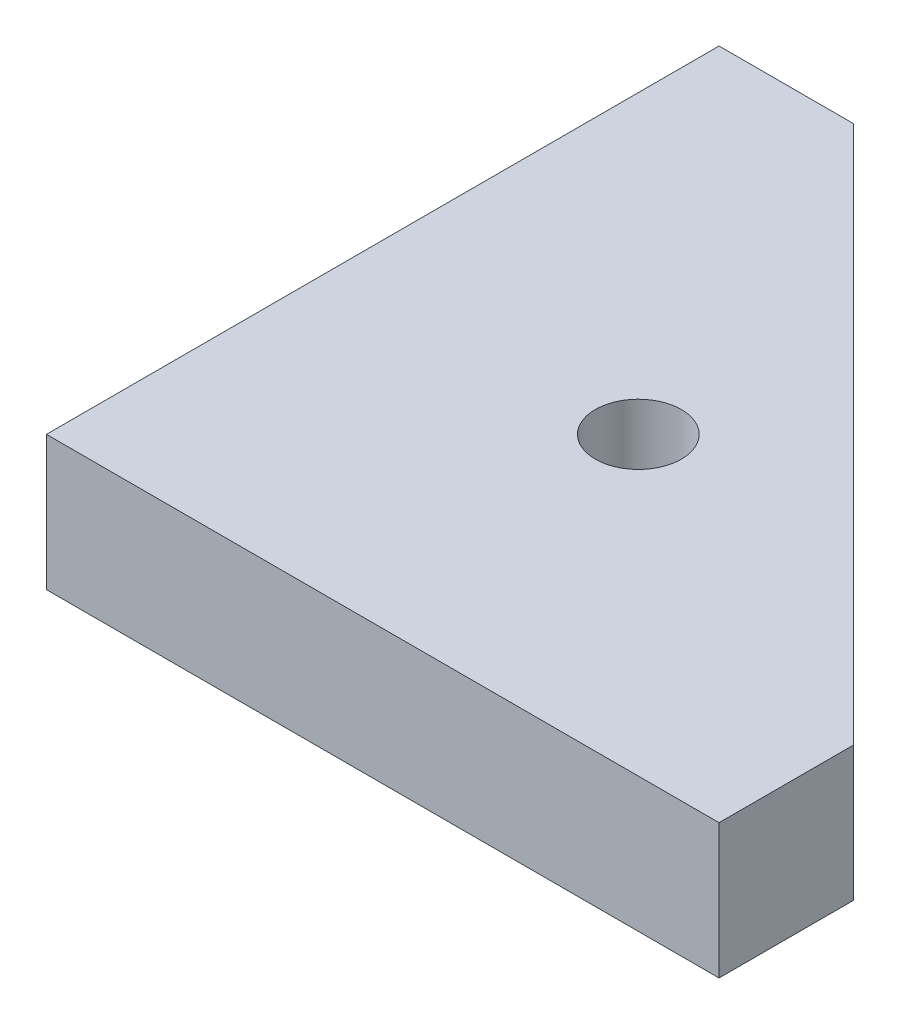
ISO-10303-21;
HEADER;
FILE_DESCRIPTION(('STEP AP214'),'2;1');
FILE_NAME('part.step','',(''),(''),'','','');
FILE_SCHEMA(('AUTOMOTIVE_DESIGN { 1 0 10303 214 1 1 1 1 }'));
ENDSEC;
DATA;
#1=APPLICATION_CONTEXT('core data for automotive mechanical design processes');
#2=APPLICATION_PROTOCOL_DEFINITION('international standard','automotive_design',2000,#1);
#3=PRODUCT_CONTEXT('',#1,'mechanical');
#4=PRODUCT('Part','Part','',(#3));
#5=PRODUCT_RELATED_PRODUCT_CATEGORY('part','',(#4));
#6=PRODUCT_DEFINITION_FORMATION('','',#4);
#7=PRODUCT_DEFINITION_CONTEXT('part definition',#1,'design');
#8=PRODUCT_DEFINITION('design','',#6,#7);
#9=PRODUCT_DEFINITION_SHAPE('','',#8);
#10=(LENGTH_UNIT() NAMED_UNIT(*) SI_UNIT(.MILLI.,.METRE.));
#11=(NAMED_UNIT(*) PLANE_ANGLE_UNIT() SI_UNIT($,.RADIAN.));
#12=(NAMED_UNIT(*) SI_UNIT($,.STERADIAN.) SOLID_ANGLE_UNIT());
#13=UNCERTAINTY_MEASURE_WITH_UNIT(LENGTH_MEASURE(1.E-05),#10,'distance_accuracy_value','');
#14=(GEOMETRIC_REPRESENTATION_CONTEXT(3) GLOBAL_UNCERTAINTY_ASSIGNED_CONTEXT((#13)) GLOBAL_UNIT_ASSIGNED_CONTEXT((#10,
#11,#12)) REPRESENTATION_CONTEXT('',''));
#15=CARTESIAN_POINT('',(0.,0.,0.));
#16=DIRECTION('',(0.,0.,1.));
#17=DIRECTION('',(1.,0.,0.));
#18=AXIS2_PLACEMENT_3D('',#15,#16,#17);
#19=CARTESIAN_POINT('',(0.,5.,0.));
#20=DIRECTION('',(0.,0.,-1.));
#21=DIRECTION('',(-1.,0.,0.));
#22=AXIS2_PLACEMENT_3D('',#19,#20,#21);
#23=PLANE('',#22);
#24=DIRECTION('',(1.,0.,0.));
#25=VECTOR('',#24,1.);
#26=CARTESIAN_POINT('',(0.,0.,0.));
#27=LINE('',#26,#25);
#28=CARTESIAN_POINT('',(0.,0.,0.));
#29=VERTEX_POINT('',#28);
#30=CARTESIAN_POINT('',(25.,0.,0.));
#31=VERTEX_POINT('',#30);
#32=EDGE_CURVE('E115',#29,#31,#27,.T.);
#33=ORIENTED_EDGE('',*,*,#32,.T.);
#34=DIRECTION('',(0.,-1.,0.));
#35=VECTOR('',#34,1.);
#36=CARTESIAN_POINT('',(25.,5.,0.));
#37=LINE('',#36,#35);
#38=CARTESIAN_POINT('',(25.,5.,0.));
#39=VERTEX_POINT('',#38);
#40=EDGE_CURVE('E11',#39,#31,#37,.T.);
#41=ORIENTED_EDGE('',*,*,#40,.F.);
#42=DIRECTION('',(1.,0.,0.));
#43=VECTOR('',#42,1.);
#44=CARTESIAN_POINT('',(0.,5.,0.));
#45=LINE('',#44,#43);
#46=CARTESIAN_POINT('',(0.,5.,0.));
#47=VERTEX_POINT('',#46);
#48=EDGE_CURVE('E200',#47,#39,#45,.T.);
#49=ORIENTED_EDGE('',*,*,#48,.F.);
#50=DIRECTION('',(0.,-1.,0.));
#51=VECTOR('',#50,1.);
#52=CARTESIAN_POINT('',(0.,5.,0.));
#53=LINE('',#52,#51);
#54=EDGE_CURVE('E54',#47,#29,#53,.T.);
#55=ORIENTED_EDGE('',*,*,#54,.T.);
#56=EDGE_LOOP('',(#33,#41,#49,#55));
#57=FACE_BOUND('',#56,.T.);
#58=ADVANCED_FACE('F37',(#57),#23,.F.);
#59=CARTESIAN_POINT('',(25.,5.,0.));
#60=DIRECTION('',(-1.,0.,0.));
#61=DIRECTION('',(0.,0.,1.));
#62=AXIS2_PLACEMENT_3D('',#59,#60,#61);
#63=PLANE('',#62);
#64=DIRECTION('',(0.,0.,-1.));
#65=VECTOR('',#64,1.);
#66=CARTESIAN_POINT('',(25.,0.,0.));
#67=LINE('',#66,#65);
#68=CARTESIAN_POINT('',(25.,0.,-5.));
#69=VERTEX_POINT('',#68);
#70=EDGE_CURVE('E117',#31,#69,#67,.T.);
#71=ORIENTED_EDGE('',*,*,#70,.T.);
#72=DIRECTION('',(0.,-1.,0.));
#73=VECTOR('',#72,1.);
#74=CARTESIAN_POINT('',(25.,5.,-5.));
#75=LINE('',#74,#73);
#76=CARTESIAN_POINT('',(25.,5.,-5.));
#77=VERTEX_POINT('',#76);
#78=EDGE_CURVE('E46',#77,#69,#75,.T.);
#79=ORIENTED_EDGE('',*,*,#78,.F.);
#80=DIRECTION('',(0.,0.,-1.));
#81=VECTOR('',#80,1.);
#82=CARTESIAN_POINT('',(25.,5.,0.));
#83=LINE('',#82,#81);
#84=EDGE_CURVE('E83',#39,#77,#83,.T.);
#85=ORIENTED_EDGE('',*,*,#84,.F.);
#86=ORIENTED_EDGE('',*,*,#40,.T.);
#87=EDGE_LOOP('',(#71,#79,#85,#86));
#88=FACE_BOUND('',#87,.T.);
#89=ADVANCED_FACE('F128',(#88),#63,.F.);
#90=CARTESIAN_POINT('',(15.,5.,-15.));
#91=DIRECTION('',(0.707106781186548,0.,-0.707106781186548));
#92=DIRECTION('',(-0.707106781186548,0.,-0.707106781186548));
#93=AXIS2_PLACEMENT_3D('',#90,#91,#92);
#94=PLANE('',#93);
#95=DIRECTION('',(0.707106781186548,0.,0.707106781186548));
#96=VECTOR('',#95,1.);
#97=CARTESIAN_POINT('',(15.,0.,-15.));
#98=LINE('',#97,#96);
#99=CARTESIAN_POINT('',(5.,0.,-25.));
#100=VERTEX_POINT('',#99);
#101=EDGE_CURVE('E95',#100,#69,#98,.T.);
#102=ORIENTED_EDGE('',*,*,#101,.F.);
#103=DIRECTION('',(0.,-1.,0.));
#104=VECTOR('',#103,1.);
#105=CARTESIAN_POINT('',(5.,5.,-25.));
#106=LINE('',#105,#104);
#107=CARTESIAN_POINT('',(5.,5.,-25.));
#108=VERTEX_POINT('',#107);
#109=EDGE_CURVE('E90',#108,#100,#106,.T.);
#110=ORIENTED_EDGE('',*,*,#109,.F.);
#111=DIRECTION('',(0.707106781186548,0.,0.707106781186548));
#112=VECTOR('',#111,1.);
#113=CARTESIAN_POINT('',(15.,5.,-15.));
#114=LINE('',#113,#112);
#115=EDGE_CURVE('E93',#108,#77,#114,.T.);
#116=ORIENTED_EDGE('',*,*,#115,.T.);
#117=ORIENTED_EDGE('',*,*,#78,.T.);
#118=EDGE_LOOP('',(#102,#110,#116,#117));
#119=FACE_BOUND('',#118,.T.);
#120=ADVANCED_FACE('F92',(#119),#94,.T.);
#121=CARTESIAN_POINT('',(0.,5.,-25.));
#122=DIRECTION('',(0.,0.,-1.));
#123=DIRECTION('',(-1.,0.,0.));
#124=AXIS2_PLACEMENT_3D('',#121,#122,#123);
#125=PLANE('',#124);
#126=DIRECTION('',(1.,0.,0.));
#127=VECTOR('',#126,1.);
#128=CARTESIAN_POINT('',(0.,0.,-25.));
#129=LINE('',#128,#127);
#130=CARTESIAN_POINT('',(0.,0.,-25.));
#131=VERTEX_POINT('',#130);
#132=EDGE_CURVE('E121',#131,#100,#129,.T.);
#133=ORIENTED_EDGE('',*,*,#132,.F.);
#134=DIRECTION('',(0.,-1.,0.));
#135=VECTOR('',#134,1.);
#136=CARTESIAN_POINT('',(0.,5.,-25.));
#137=LINE('',#136,#135);
#138=CARTESIAN_POINT('',(0.,5.,-25.));
#139=VERTEX_POINT('',#138);
#140=EDGE_CURVE('E71',#139,#131,#137,.T.);
#141=ORIENTED_EDGE('',*,*,#140,.F.);
#142=DIRECTION('',(1.,0.,0.));
#143=VECTOR('',#142,1.);
#144=CARTESIAN_POINT('',(0.,5.,-25.));
#145=LINE('',#144,#143);
#146=EDGE_CURVE('E104',#139,#108,#145,.T.);
#147=ORIENTED_EDGE('',*,*,#146,.T.);
#148=ORIENTED_EDGE('',*,*,#109,.T.);
#149=EDGE_LOOP('',(#133,#141,#147,#148));
#150=FACE_BOUND('',#149,.T.);
#151=ADVANCED_FACE('F106',(#150),#125,.T.);
#152=CARTESIAN_POINT('',(11.,5.,-11.));
#153=DIRECTION('',(0.,-1.,0.));
#154=DIRECTION('',(0.,0.,-1.));
#155=AXIS2_PLACEMENT_3D('',#152,#153,#154);
#156=CYLINDRICAL_SURFACE('',#155,1.6);
#157=CARTESIAN_POINT('',(11.,5.,-11.));
#158=DIRECTION('',(0.,1.,0.));
#159=DIRECTION('',(0.,0.,1.));
#160=AXIS2_PLACEMENT_3D('',#157,#158,#159);
#161=CIRCLE('',#160,1.6);
#162=CARTESIAN_POINT('',(11.,5.,-9.4));
#163=VERTEX_POINT('',#162);
#164=EDGE_CURVE('E126',#163,#163,#161,.T.);
#165=ORIENTED_EDGE('',*,*,#164,.T.);
#166=EDGE_LOOP('',(#165));
#167=FACE_BOUND('',#166,.T.);
#168=CARTESIAN_POINT('',(11.,0.,-11.));
#169=DIRECTION('',(0.,1.,0.));
#170=DIRECTION('',(0.,0.,1.));
#171=AXIS2_PLACEMENT_3D('',#168,#169,#170);
#172=CIRCLE('',#171,1.6);
#173=CARTESIAN_POINT('',(11.,0.,-9.4));
#174=VERTEX_POINT('',#173);
#175=EDGE_CURVE('E112',#174,#174,#172,.T.);
#176=ORIENTED_EDGE('',*,*,#175,.F.);
#177=EDGE_LOOP('',(#176));
#178=FACE_BOUND('',#177,.T.);
#179=ADVANCED_FACE('F39',(#167,#178),#156,.F.);
#180=CARTESIAN_POINT('',(0.,5.,0.));
#181=DIRECTION('',(-1.,0.,0.));
#182=DIRECTION('',(0.,0.,1.));
#183=AXIS2_PLACEMENT_3D('',#180,#181,#182);
#184=PLANE('',#183);
#185=DIRECTION('',(0.,0.,-1.));
#186=VECTOR('',#185,1.);
#187=CARTESIAN_POINT('',(0.,0.,0.));
#188=LINE('',#187,#186);
#189=EDGE_CURVE('E123',#29,#131,#188,.T.);
#190=ORIENTED_EDGE('',*,*,#189,.F.);
#191=ORIENTED_EDGE('',*,*,#54,.F.);
#192=DIRECTION('',(0.,0.,-1.));
#193=VECTOR('',#192,1.);
#194=CARTESIAN_POINT('',(0.,5.,0.));
#195=LINE('',#194,#193);
#196=EDGE_CURVE('E107',#47,#139,#195,.T.);
#197=ORIENTED_EDGE('',*,*,#196,.T.);
#198=ORIENTED_EDGE('',*,*,#140,.T.);
#199=EDGE_LOOP('',(#190,#191,#197,#198));
#200=FACE_BOUND('',#199,.T.);
#201=ADVANCED_FACE('F132',(#200),#184,.T.);
#202=CARTESIAN_POINT('',(0.,5.,0.));
#203=DIRECTION('',(0.,1.,0.));
#204=DIRECTION('',(0.,0.,1.));
#205=AXIS2_PLACEMENT_3D('',#202,#203,#204);
#206=PLANE('',#205);
#207=ORIENTED_EDGE('',*,*,#164,.F.);
#208=EDGE_LOOP('',(#207));
#209=FACE_BOUND('',#208,.T.);
#210=ORIENTED_EDGE('',*,*,#48,.T.);
#211=ORIENTED_EDGE('',*,*,#84,.T.);
#212=ORIENTED_EDGE('',*,*,#115,.F.);
#213=ORIENTED_EDGE('',*,*,#146,.F.);
#214=ORIENTED_EDGE('',*,*,#196,.F.);
#215=EDGE_LOOP('',(#210,#211,#212,#213,#214));
#216=FACE_BOUND('',#215,.T.);
#217=ADVANCED_FACE('F102',(#209,#216),#206,.T.);
#218=CARTESIAN_POINT('',(0.,0.,0.));
#219=DIRECTION('',(0.,1.,0.));
#220=DIRECTION('',(0.,0.,1.));
#221=AXIS2_PLACEMENT_3D('',#218,#219,#220);
#222=PLANE('',#221);
#223=ORIENTED_EDGE('',*,*,#175,.T.);
#224=EDGE_LOOP('',(#223));
#225=FACE_BOUND('',#224,.T.);
#226=ORIENTED_EDGE('',*,*,#32,.F.);
#227=ORIENTED_EDGE('',*,*,#189,.T.);
#228=ORIENTED_EDGE('',*,*,#132,.T.);
#229=ORIENTED_EDGE('',*,*,#101,.T.);
#230=ORIENTED_EDGE('',*,*,#70,.F.);
#231=EDGE_LOOP('',(#226,#227,#228,#229,#230));
#232=FACE_BOUND('',#231,.T.);
#233=ADVANCED_FACE('F131',(#225,#232),#222,.F.);
#234=CLOSED_SHELL('',(#58,#89,#120,#151,#179,#201,#217,#233));
#235=MANIFOLD_SOLID_BREP('B2',#234);
#236=ADVANCED_BREP_SHAPE_REPRESENTATION('',(#18,#235),#14);
#237=SHAPE_DEFINITION_REPRESENTATION(#9,#236);
ENDSEC;
END-ISO-10303-21;
